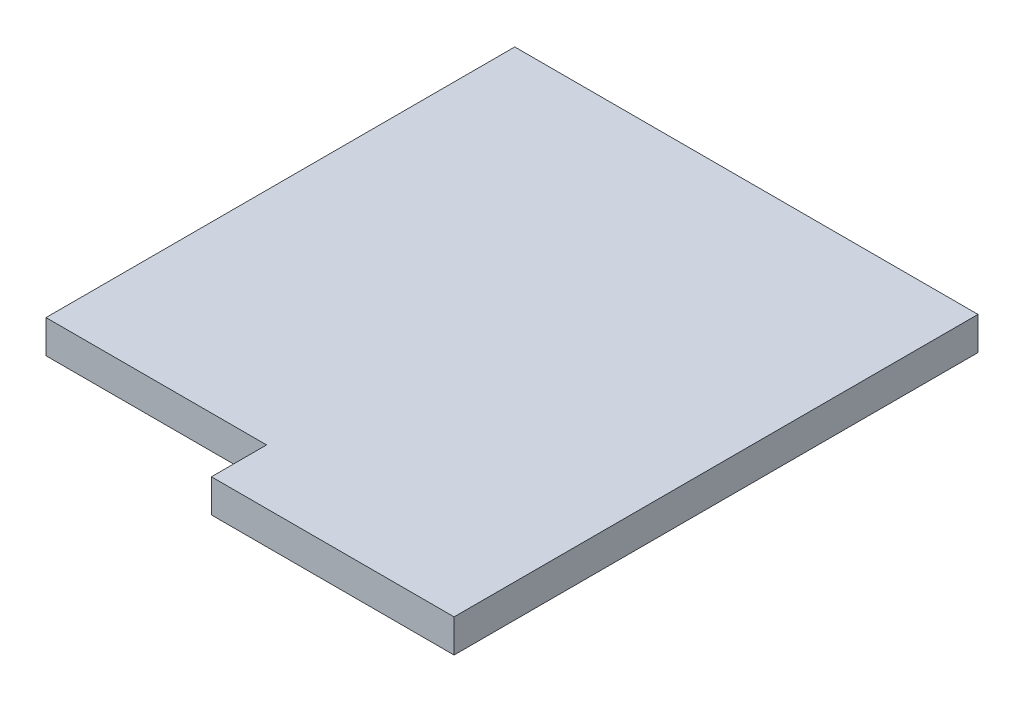
ISO-10303-21;
HEADER;
FILE_DESCRIPTION(('STEP AP214'),'2;1');
FILE_NAME('part.step','',(''),(''),'','','');
FILE_SCHEMA(('AUTOMOTIVE_DESIGN { 1 0 10303 214 1 1 1 1 }'));
ENDSEC;
DATA;
#1=APPLICATION_CONTEXT('core data for automotive mechanical design processes');
#2=APPLICATION_PROTOCOL_DEFINITION('international standard','automotive_design',2000,#1);
#3=PRODUCT_CONTEXT('',#1,'mechanical');
#4=PRODUCT('Part','Part','',(#3));
#5=PRODUCT_RELATED_PRODUCT_CATEGORY('part','',(#4));
#6=PRODUCT_DEFINITION_FORMATION('','',#4);
#7=PRODUCT_DEFINITION_CONTEXT('part definition',#1,'design');
#8=PRODUCT_DEFINITION('design','',#6,#7);
#9=PRODUCT_DEFINITION_SHAPE('','',#8);
#10=(LENGTH_UNIT() NAMED_UNIT(*) SI_UNIT(.MILLI.,.METRE.));
#11=(NAMED_UNIT(*) PLANE_ANGLE_UNIT() SI_UNIT($,.RADIAN.));
#12=(NAMED_UNIT(*) SI_UNIT($,.STERADIAN.) SOLID_ANGLE_UNIT());
#13=UNCERTAINTY_MEASURE_WITH_UNIT(LENGTH_MEASURE(1.E-05),#10,'distance_accuracy_value','');
#14=(GEOMETRIC_REPRESENTATION_CONTEXT(3) GLOBAL_UNCERTAINTY_ASSIGNED_CONTEXT((#13)) GLOBAL_UNIT_ASSIGNED_CONTEXT((#10,
#11,#12)) REPRESENTATION_CONTEXT('',''));
#15=CARTESIAN_POINT('',(0.,0.,0.));
#16=DIRECTION('',(0.,0.,1.));
#17=DIRECTION('',(1.,0.,0.));
#18=AXIS2_PLACEMENT_3D('',#15,#16,#17);
#19=CARTESIAN_POINT('',(-21.,3.,23.75));
#20=DIRECTION('',(1.,0.,0.));
#21=DIRECTION('',(0.,0.,-1.));
#22=AXIS2_PLACEMENT_3D('',#19,#20,#21);
#23=PLANE('',#22);
#24=DIRECTION('',(0.,-1.,0.));
#25=VECTOR('',#24,1.);
#26=CARTESIAN_POINT('',(-21.,5.,18.75));
#27=LINE('',#26,#25);
#28=CARTESIAN_POINT('',(-21.,3.,18.75));
#29=VERTEX_POINT('',#28);
#30=CARTESIAN_POINT('',(-21.,0.,18.75));
#31=VERTEX_POINT('',#30);
#32=EDGE_CURVE('E51',#29,#31,#27,.T.);
#33=ORIENTED_EDGE('',*,*,#32,.F.);
#34=DIRECTION('',(0.,0.,1.));
#35=VECTOR('',#34,1.);
#36=CARTESIAN_POINT('',(-21.,3.,23.75));
#37=LINE('',#36,#35);
#38=CARTESIAN_POINT('',(-21.,3.,-23.75));
#39=VERTEX_POINT('',#38);
#40=EDGE_CURVE('E129',#39,#29,#37,.T.);
#41=ORIENTED_EDGE('',*,*,#40,.F.);
#42=DIRECTION('',(0.,-1.,0.));
#43=VECTOR('',#42,1.);
#44=CARTESIAN_POINT('',(-21.,3.,-23.75));
#45=LINE('',#44,#43);
#46=CARTESIAN_POINT('',(-21.,0.,-23.75));
#47=VERTEX_POINT('',#46);
#48=EDGE_CURVE('E44',#39,#47,#45,.T.);
#49=ORIENTED_EDGE('',*,*,#48,.T.);
#50=DIRECTION('',(0.,0.,1.));
#51=VECTOR('',#50,1.);
#52=CARTESIAN_POINT('',(-21.,0.,23.75));
#53=LINE('',#52,#51);
#54=EDGE_CURVE('E115',#47,#31,#53,.T.);
#55=ORIENTED_EDGE('',*,*,#54,.T.);
#56=EDGE_LOOP('',(#33,#41,#49,#55));
#57=FACE_BOUND('',#56,.T.);
#58=ADVANCED_FACE('F36',(#57),#23,.F.);
#59=CARTESIAN_POINT('',(-21.,3.,23.75));
#60=DIRECTION('',(0.,0.,-1.));
#61=DIRECTION('',(-1.,0.,0.));
#62=AXIS2_PLACEMENT_3D('',#59,#60,#61);
#63=PLANE('',#62);
#64=DIRECTION('',(0.,-1.,0.));
#65=VECTOR('',#64,1.);
#66=CARTESIAN_POINT('',(-1.,5.,23.75));
#67=LINE('',#66,#65);
#68=CARTESIAN_POINT('',(-1.,3.,23.75));
#69=VERTEX_POINT('',#68);
#70=CARTESIAN_POINT('',(-1.,0.,23.75));
#71=VERTEX_POINT('',#70);
#72=EDGE_CURVE('E101',#69,#71,#67,.T.);
#73=ORIENTED_EDGE('',*,*,#72,.T.);
#74=DIRECTION('',(1.,0.,0.));
#75=VECTOR('',#74,1.);
#76=CARTESIAN_POINT('',(-21.,0.,23.75));
#77=LINE('',#76,#75);
#78=CARTESIAN_POINT('',(21.,0.,23.75));
#79=VERTEX_POINT('',#78);
#80=EDGE_CURVE('E78',#71,#79,#77,.T.);
#81=ORIENTED_EDGE('',*,*,#80,.T.);
#82=DIRECTION('',(0.,-1.,0.));
#83=VECTOR('',#82,1.);
#84=CARTESIAN_POINT('',(21.,3.,23.75));
#85=LINE('',#84,#83);
#86=CARTESIAN_POINT('',(21.,3.,23.75));
#87=VERTEX_POINT('',#86);
#88=EDGE_CURVE('E123',#87,#79,#85,.T.);
#89=ORIENTED_EDGE('',*,*,#88,.F.);
#90=DIRECTION('',(1.,0.,0.));
#91=VECTOR('',#90,1.);
#92=CARTESIAN_POINT('',(-21.,3.,23.75));
#93=LINE('',#92,#91);
#94=EDGE_CURVE('E60',#69,#87,#93,.T.);
#95=ORIENTED_EDGE('',*,*,#94,.F.);
#96=EDGE_LOOP('',(#73,#81,#89,#95));
#97=FACE_BOUND('',#96,.T.);
#98=ADVANCED_FACE('F107',(#97),#63,.F.);
#99=CARTESIAN_POINT('',(0.,3.,0.));
#100=DIRECTION('',(0.,-1.,0.));
#101=DIRECTION('',(0.,0.,-1.));
#102=AXIS2_PLACEMENT_3D('',#99,#100,#101);
#103=PLANE('',#102);
#104=DIRECTION('',(0.,0.,-1.));
#105=VECTOR('',#104,1.);
#106=CARTESIAN_POINT('',(-1.,3.,0.));
#107=LINE('',#106,#105);
#108=CARTESIAN_POINT('',(-1.,3.,18.75));
#109=VERTEX_POINT('',#108);
#110=EDGE_CURVE('E135',#69,#109,#107,.T.);
#111=ORIENTED_EDGE('',*,*,#110,.F.);
#112=ORIENTED_EDGE('',*,*,#94,.T.);
#113=DIRECTION('',(0.,0.,-1.));
#114=VECTOR('',#113,1.);
#115=CARTESIAN_POINT('',(21.,3.,23.75));
#116=LINE('',#115,#114);
#117=CARTESIAN_POINT('',(21.,3.,-23.75));
#118=VERTEX_POINT('',#117);
#119=EDGE_CURVE('E114',#87,#118,#116,.T.);
#120=ORIENTED_EDGE('',*,*,#119,.T.);
#121=DIRECTION('',(-1.,0.,0.));
#122=VECTOR('',#121,1.);
#123=CARTESIAN_POINT('',(-21.,3.,-23.75));
#124=LINE('',#123,#122);
#125=EDGE_CURVE('E83',#118,#39,#124,.T.);
#126=ORIENTED_EDGE('',*,*,#125,.T.);
#127=ORIENTED_EDGE('',*,*,#40,.T.);
#128=DIRECTION('',(-1.,0.,0.));
#129=VECTOR('',#128,1.);
#130=CARTESIAN_POINT('',(0.,3.,18.75));
#131=LINE('',#130,#129);
#132=EDGE_CURVE('E108',#109,#29,#131,.T.);
#133=ORIENTED_EDGE('',*,*,#132,.F.);
#134=EDGE_LOOP('',(#111,#112,#120,#126,#127,#133));
#135=FACE_BOUND('',#134,.T.);
#136=ADVANCED_FACE('F144',(#135),#103,.F.);
#137=CARTESIAN_POINT('',(0.,0.,0.));
#138=DIRECTION('',(0.,-1.,0.));
#139=DIRECTION('',(0.,0.,-1.));
#140=AXIS2_PLACEMENT_3D('',#137,#138,#139);
#141=PLANE('',#140);
#142=ORIENTED_EDGE('',*,*,#80,.F.);
#143=DIRECTION('',(0.,0.,-1.));
#144=VECTOR('',#143,1.);
#145=CARTESIAN_POINT('',(-1.,0.,23.75));
#146=LINE('',#145,#144);
#147=CARTESIAN_POINT('',(-1.,0.,18.75));
#148=VERTEX_POINT('',#147);
#149=EDGE_CURVE('E99',#71,#148,#146,.T.);
#150=ORIENTED_EDGE('',*,*,#149,.T.);
#151=DIRECTION('',(-1.,0.,0.));
#152=VECTOR('',#151,1.);
#153=CARTESIAN_POINT('',(-21.,0.,18.75));
#154=LINE('',#153,#152);
#155=EDGE_CURVE('E105',#148,#31,#154,.T.);
#156=ORIENTED_EDGE('',*,*,#155,.T.);
#157=ORIENTED_EDGE('',*,*,#54,.F.);
#158=DIRECTION('',(-1.,0.,0.));
#159=VECTOR('',#158,1.);
#160=CARTESIAN_POINT('',(-21.,0.,-23.75));
#161=LINE('',#160,#159);
#162=CARTESIAN_POINT('',(21.,0.,-23.75));
#163=VERTEX_POINT('',#162);
#164=EDGE_CURVE('E119',#163,#47,#161,.T.);
#165=ORIENTED_EDGE('',*,*,#164,.F.);
#166=DIRECTION('',(0.,0.,-1.));
#167=VECTOR('',#166,1.);
#168=CARTESIAN_POINT('',(21.,0.,23.75));
#169=LINE('',#168,#167);
#170=EDGE_CURVE('E113',#79,#163,#169,.T.);
#171=ORIENTED_EDGE('',*,*,#170,.F.);
#172=EDGE_LOOP('',(#142,#150,#156,#157,#165,#171));
#173=FACE_BOUND('',#172,.T.);
#174=ADVANCED_FACE('F111',(#173),#141,.T.);
#175=CARTESIAN_POINT('',(21.,3.,23.75));
#176=DIRECTION('',(-1.,0.,0.));
#177=DIRECTION('',(0.,0.,1.));
#178=AXIS2_PLACEMENT_3D('',#175,#176,#177);
#179=PLANE('',#178);
#180=ORIENTED_EDGE('',*,*,#170,.T.);
#181=DIRECTION('',(0.,-1.,0.));
#182=VECTOR('',#181,1.);
#183=CARTESIAN_POINT('',(21.,3.,-23.75));
#184=LINE('',#183,#182);
#185=EDGE_CURVE('E11',#118,#163,#184,.T.);
#186=ORIENTED_EDGE('',*,*,#185,.F.);
#187=ORIENTED_EDGE('',*,*,#119,.F.);
#188=ORIENTED_EDGE('',*,*,#88,.T.);
#189=EDGE_LOOP('',(#180,#186,#187,#188));
#190=FACE_BOUND('',#189,.T.);
#191=ADVANCED_FACE('F38',(#190),#179,.F.);
#192=CARTESIAN_POINT('',(-21.,3.,-23.75));
#193=DIRECTION('',(0.,0.,1.));
#194=DIRECTION('',(1.,0.,0.));
#195=AXIS2_PLACEMENT_3D('',#192,#193,#194);
#196=PLANE('',#195);
#197=ORIENTED_EDGE('',*,*,#164,.T.);
#198=ORIENTED_EDGE('',*,*,#48,.F.);
#199=ORIENTED_EDGE('',*,*,#125,.F.);
#200=ORIENTED_EDGE('',*,*,#185,.T.);
#201=EDGE_LOOP('',(#197,#198,#199,#200));
#202=FACE_BOUND('',#201,.T.);
#203=ADVANCED_FACE('F140',(#202),#196,.F.);
#204=CARTESIAN_POINT('',(-1.,5.,23.75));
#205=DIRECTION('',(-1.,0.,0.));
#206=DIRECTION('',(0.,0.,1.));
#207=AXIS2_PLACEMENT_3D('',#204,#205,#206);
#208=PLANE('',#207);
#209=ORIENTED_EDGE('',*,*,#110,.T.);
#210=DIRECTION('',(0.,-1.,0.));
#211=VECTOR('',#210,1.);
#212=CARTESIAN_POINT('',(-1.,5.,18.75));
#213=LINE('',#212,#211);
#214=EDGE_CURVE('E103',#109,#148,#213,.T.);
#215=ORIENTED_EDGE('',*,*,#214,.T.);
#216=ORIENTED_EDGE('',*,*,#149,.F.);
#217=ORIENTED_EDGE('',*,*,#72,.F.);
#218=EDGE_LOOP('',(#209,#215,#216,#217));
#219=FACE_BOUND('',#218,.T.);
#220=ADVANCED_FACE('F100',(#219),#208,.T.);
#221=CARTESIAN_POINT('',(-21.,5.,18.75));
#222=DIRECTION('',(0.,0.,1.));
#223=DIRECTION('',(1.,0.,0.));
#224=AXIS2_PLACEMENT_3D('',#221,#222,#223);
#225=PLANE('',#224);
#226=ORIENTED_EDGE('',*,*,#132,.T.);
#227=ORIENTED_EDGE('',*,*,#32,.T.);
#228=ORIENTED_EDGE('',*,*,#155,.F.);
#229=ORIENTED_EDGE('',*,*,#214,.F.);
#230=EDGE_LOOP('',(#226,#227,#228,#229));
#231=FACE_BOUND('',#230,.T.);
#232=ADVANCED_FACE('F146',(#231),#225,.T.);
#233=CLOSED_SHELL('',(#58,#98,#136,#174,#191,#203,#220,#232));
#234=MANIFOLD_SOLID_BREP('B2',#233);
#235=ADVANCED_BREP_SHAPE_REPRESENTATION('',(#18,#234),#14);
#236=SHAPE_DEFINITION_REPRESENTATION(#9,#235);
ENDSEC;
END-ISO-10303-21;
